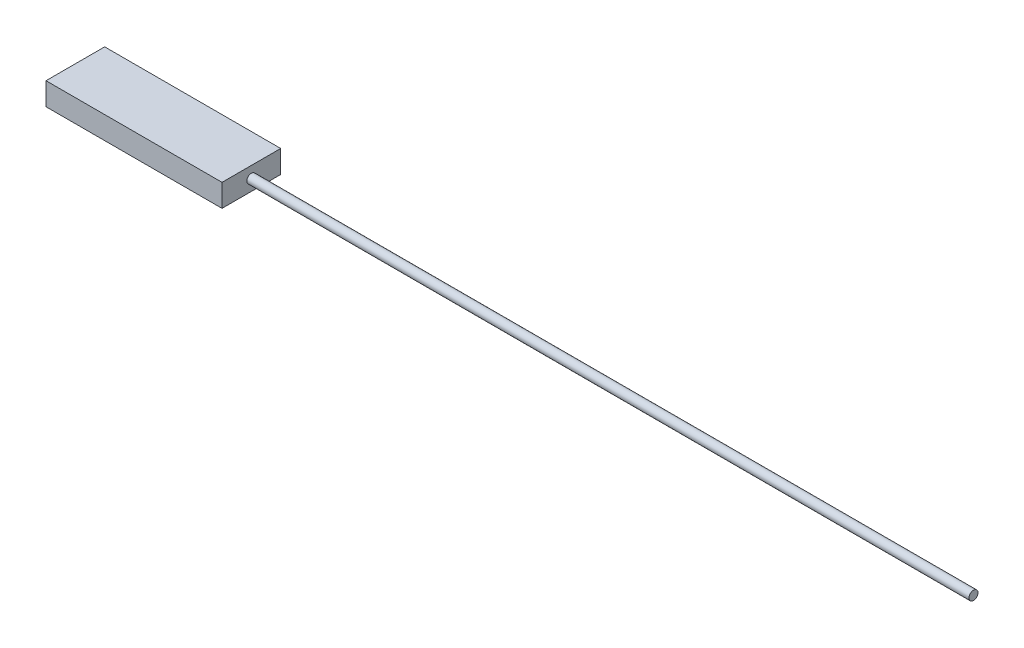
ISO-10303-21;
HEADER;
FILE_DESCRIPTION(('STEP AP214'),'2;1');
FILE_NAME('part.step','',(''),(''),'','','');
FILE_SCHEMA(('AUTOMOTIVE_DESIGN { 1 0 10303 214 1 1 1 1 }'));
ENDSEC;
DATA;
#1=APPLICATION_CONTEXT('core data for automotive mechanical design processes');
#2=APPLICATION_PROTOCOL_DEFINITION('international standard','automotive_design',2000,#1);
#3=PRODUCT_CONTEXT('',#1,'mechanical');
#4=PRODUCT('Part','Part','',(#3));
#5=PRODUCT_RELATED_PRODUCT_CATEGORY('part','',(#4));
#6=PRODUCT_DEFINITION_FORMATION('','',#4);
#7=PRODUCT_DEFINITION_CONTEXT('part definition',#1,'design');
#8=PRODUCT_DEFINITION('design','',#6,#7);
#9=PRODUCT_DEFINITION_SHAPE('','',#8);
#10=(LENGTH_UNIT() NAMED_UNIT(*) SI_UNIT(.MILLI.,.METRE.));
#11=(NAMED_UNIT(*) PLANE_ANGLE_UNIT() SI_UNIT($,.RADIAN.));
#12=(NAMED_UNIT(*) SI_UNIT($,.STERADIAN.) SOLID_ANGLE_UNIT());
#13=UNCERTAINTY_MEASURE_WITH_UNIT(LENGTH_MEASURE(1.E-05),#10,'distance_accuracy_value','');
#14=(GEOMETRIC_REPRESENTATION_CONTEXT(3) GLOBAL_UNCERTAINTY_ASSIGNED_CONTEXT((#13)) GLOBAL_UNIT_ASSIGNED_CONTEXT((#10,
#11,#12)) REPRESENTATION_CONTEXT('',''));
#15=CARTESIAN_POINT('',(0.,0.,0.));
#16=DIRECTION('',(0.,0.,1.));
#17=DIRECTION('',(1.,0.,0.));
#18=AXIS2_PLACEMENT_3D('',#15,#16,#17);
#19=CARTESIAN_POINT('',(49.53,12.7,16.51));
#20=DIRECTION('',(-1.,0.,0.));
#21=DIRECTION('',(0.,0.,1.));
#22=AXIS2_PLACEMENT_3D('',#19,#20,#21);
#23=PLANE('',#22);
#24=CARTESIAN_POINT('',(49.53,6.35,0.));
#25=DIRECTION('',(-1.,0.,0.));
#26=DIRECTION('',(0.,0.,1.));
#27=AXIS2_PLACEMENT_3D('',#24,#25,#26);
#28=CIRCLE('',#27,2.54);
#29=CARTESIAN_POINT('',(49.53,6.35,2.54));
#30=VERTEX_POINT('',#29);
#31=EDGE_CURVE('E11',#30,#30,#28,.F.);
#32=ORIENTED_EDGE('',*,*,#31,.F.);
#33=EDGE_LOOP('',(#32));
#34=FACE_BOUND('',#33,.T.);
#35=DIRECTION('',(0.,0.,-1.));
#36=VECTOR('',#35,1.);
#37=CARTESIAN_POINT('',(49.53,0.,16.51));
#38=LINE('',#37,#36);
#39=CARTESIAN_POINT('',(49.53,0.,16.51));
#40=VERTEX_POINT('',#39);
#41=CARTESIAN_POINT('',(49.53,0.,-16.51));
#42=VERTEX_POINT('',#41);
#43=EDGE_CURVE('E99',#40,#42,#38,.T.);
#44=ORIENTED_EDGE('',*,*,#43,.T.);
#45=DIRECTION('',(0.,-1.,0.));
#46=VECTOR('',#45,1.);
#47=CARTESIAN_POINT('',(49.53,12.7,-16.51));
#48=LINE('',#47,#46);
#49=CARTESIAN_POINT('',(49.53,12.7,-16.51));
#50=VERTEX_POINT('',#49);
#51=EDGE_CURVE('E41',#50,#42,#48,.T.);
#52=ORIENTED_EDGE('',*,*,#51,.F.);
#53=DIRECTION('',(0.,0.,-1.));
#54=VECTOR('',#53,1.);
#55=CARTESIAN_POINT('',(49.53,12.7,16.51));
#56=LINE('',#55,#54);
#57=CARTESIAN_POINT('',(49.53,12.7,16.51));
#58=VERTEX_POINT('',#57);
#59=EDGE_CURVE('E85',#58,#50,#56,.T.);
#60=ORIENTED_EDGE('',*,*,#59,.F.);
#61=DIRECTION('',(0.,-1.,0.));
#62=VECTOR('',#61,1.);
#63=CARTESIAN_POINT('',(49.53,12.7,16.51));
#64=LINE('',#63,#62);
#65=EDGE_CURVE('E95',#58,#40,#64,.T.);
#66=ORIENTED_EDGE('',*,*,#65,.T.);
#67=EDGE_LOOP('',(#44,#52,#60,#66));
#68=FACE_BOUND('',#67,.T.);
#69=ADVANCED_FACE('F33',(#34,#68),#23,.F.);
#70=CARTESIAN_POINT('',(-49.53,12.7,-16.51));
#71=DIRECTION('',(0.,0.,1.));
#72=DIRECTION('',(1.,0.,0.));
#73=AXIS2_PLACEMENT_3D('',#70,#71,#72);
#74=PLANE('',#73);
#75=DIRECTION('',(-1.,0.,0.));
#76=VECTOR('',#75,1.);
#77=CARTESIAN_POINT('',(-49.53,0.,-16.51));
#78=LINE('',#77,#76);
#79=CARTESIAN_POINT('',(-49.53,0.,-16.51));
#80=VERTEX_POINT('',#79);
#81=EDGE_CURVE('E90',#42,#80,#78,.T.);
#82=ORIENTED_EDGE('',*,*,#81,.T.);
#83=DIRECTION('',(0.,-1.,0.));
#84=VECTOR('',#83,1.);
#85=CARTESIAN_POINT('',(-49.53,12.7,-16.51));
#86=LINE('',#85,#84);
#87=CARTESIAN_POINT('',(-49.53,12.7,-16.51));
#88=VERTEX_POINT('',#87);
#89=EDGE_CURVE('E88',#88,#80,#86,.T.);
#90=ORIENTED_EDGE('',*,*,#89,.F.);
#91=DIRECTION('',(-1.,0.,0.));
#92=VECTOR('',#91,1.);
#93=CARTESIAN_POINT('',(-49.53,12.7,-16.51));
#94=LINE('',#93,#92);
#95=EDGE_CURVE('E80',#50,#88,#94,.T.);
#96=ORIENTED_EDGE('',*,*,#95,.F.);
#97=ORIENTED_EDGE('',*,*,#51,.T.);
#98=EDGE_LOOP('',(#82,#90,#96,#97));
#99=FACE_BOUND('',#98,.T.);
#100=ADVANCED_FACE('F89',(#99),#74,.F.);
#101=CARTESIAN_POINT('',(-49.53,12.7,16.51));
#102=DIRECTION('',(1.,0.,0.));
#103=DIRECTION('',(0.,0.,-1.));
#104=AXIS2_PLACEMENT_3D('',#101,#102,#103);
#105=PLANE('',#104);
#106=DIRECTION('',(0.,0.,1.));
#107=VECTOR('',#106,1.);
#108=CARTESIAN_POINT('',(-49.53,0.,16.51));
#109=LINE('',#108,#107);
#110=CARTESIAN_POINT('',(-49.53,0.,16.51));
#111=VERTEX_POINT('',#110);
#112=EDGE_CURVE('E66',#80,#111,#109,.T.);
#113=ORIENTED_EDGE('',*,*,#112,.T.);
#114=DIRECTION('',(0.,-1.,0.));
#115=VECTOR('',#114,1.);
#116=CARTESIAN_POINT('',(-49.53,12.7,16.51));
#117=LINE('',#116,#115);
#118=CARTESIAN_POINT('',(-49.53,12.7,16.51));
#119=VERTEX_POINT('',#118);
#120=EDGE_CURVE('E91',#119,#111,#117,.T.);
#121=ORIENTED_EDGE('',*,*,#120,.F.);
#122=DIRECTION('',(0.,0.,1.));
#123=VECTOR('',#122,1.);
#124=CARTESIAN_POINT('',(-49.53,12.7,16.51));
#125=LINE('',#124,#123);
#126=EDGE_CURVE('E83',#88,#119,#125,.T.);
#127=ORIENTED_EDGE('',*,*,#126,.F.);
#128=ORIENTED_EDGE('',*,*,#89,.T.);
#129=EDGE_LOOP('',(#113,#121,#127,#128));
#130=FACE_BOUND('',#129,.T.);
#131=ADVANCED_FACE('F93',(#130),#105,.F.);
#132=CARTESIAN_POINT('',(-49.53,12.7,16.51));
#133=DIRECTION('',(0.,0.,-1.));
#134=DIRECTION('',(-1.,0.,0.));
#135=AXIS2_PLACEMENT_3D('',#132,#133,#134);
#136=PLANE('',#135);
#137=DIRECTION('',(1.,0.,0.));
#138=VECTOR('',#137,1.);
#139=CARTESIAN_POINT('',(-49.53,0.,16.51));
#140=LINE('',#139,#138);
#141=EDGE_CURVE('E72',#111,#40,#140,.T.);
#142=ORIENTED_EDGE('',*,*,#141,.T.);
#143=ORIENTED_EDGE('',*,*,#65,.F.);
#144=DIRECTION('',(1.,0.,0.));
#145=VECTOR('',#144,1.);
#146=CARTESIAN_POINT('',(-49.53,12.7,16.51));
#147=LINE('',#146,#145);
#148=EDGE_CURVE('E49',#119,#58,#147,.T.);
#149=ORIENTED_EDGE('',*,*,#148,.F.);
#150=ORIENTED_EDGE('',*,*,#120,.T.);
#151=EDGE_LOOP('',(#142,#143,#149,#150));
#152=FACE_BOUND('',#151,.T.);
#153=ADVANCED_FACE('F121',(#152),#136,.F.);
#154=CARTESIAN_POINT('',(0.,12.7,0.));
#155=DIRECTION('',(0.,-1.,0.));
#156=DIRECTION('',(0.,0.,-1.));
#157=AXIS2_PLACEMENT_3D('',#154,#155,#156);
#158=PLANE('',#157);
#159=ORIENTED_EDGE('',*,*,#59,.T.);
#160=ORIENTED_EDGE('',*,*,#95,.T.);
#161=ORIENTED_EDGE('',*,*,#126,.T.);
#162=ORIENTED_EDGE('',*,*,#148,.T.);
#163=EDGE_LOOP('',(#159,#160,#161,#162));
#164=FACE_BOUND('',#163,.T.);
#165=ADVANCED_FACE('F81',(#164),#158,.F.);
#166=CARTESIAN_POINT('',(0.,0.,0.));
#167=DIRECTION('',(0.,-1.,0.));
#168=DIRECTION('',(0.,0.,-1.));
#169=AXIS2_PLACEMENT_3D('',#166,#167,#168);
#170=PLANE('',#169);
#171=ORIENTED_EDGE('',*,*,#43,.F.);
#172=ORIENTED_EDGE('',*,*,#141,.F.);
#173=ORIENTED_EDGE('',*,*,#112,.F.);
#174=ORIENTED_EDGE('',*,*,#81,.F.);
#175=EDGE_LOOP('',(#171,#172,#173,#174));
#176=FACE_BOUND('',#175,.T.);
#177=ADVANCED_FACE('F110',(#176),#170,.T.);
#178=CARTESIAN_POINT('',(455.93,6.35,0.));
#179=DIRECTION('',(-1.,0.,0.));
#180=DIRECTION('',(0.,0.,1.));
#181=AXIS2_PLACEMENT_3D('',#178,#179,#180);
#182=CYLINDRICAL_SURFACE('',#181,2.54);
#183=CARTESIAN_POINT('',(455.93,6.35,0.));
#184=DIRECTION('',(1.,0.,0.));
#185=DIRECTION('',(0.,0.,-1.));
#186=AXIS2_PLACEMENT_3D('',#183,#184,#185);
#187=CIRCLE('',#186,2.54);
#188=CARTESIAN_POINT('',(455.93,6.35,-2.54));
#189=VERTEX_POINT('',#188);
#190=EDGE_CURVE('E102',#189,#189,#187,.T.);
#191=ORIENTED_EDGE('',*,*,#190,.F.);
#192=EDGE_LOOP('',(#191));
#193=FACE_BOUND('',#192,.T.);
#194=ORIENTED_EDGE('',*,*,#31,.T.);
#195=EDGE_LOOP('',(#194));
#196=FACE_BOUND('',#195,.T.);
#197=ADVANCED_FACE('F112',(#193,#196),#182,.T.);
#198=CARTESIAN_POINT('',(455.93,6.35,0.));
#199=DIRECTION('',(1.,0.,0.));
#200=DIRECTION('',(0.,0.,-1.));
#201=AXIS2_PLACEMENT_3D('',#198,#199,#200);
#202=PLANE('',#201);
#203=ORIENTED_EDGE('',*,*,#190,.T.);
#204=EDGE_LOOP('',(#203));
#205=FACE_BOUND('',#204,.T.);
#206=ADVANCED_FACE('F118',(#205),#202,.T.);
#207=CLOSED_SHELL('',(#69,#100,#131,#153,#165,#177,#197,#206));
#208=MANIFOLD_SOLID_BREP('B2',#207);
#209=ADVANCED_BREP_SHAPE_REPRESENTATION('',(#18,#208),#14);
#210=SHAPE_DEFINITION_REPRESENTATION(#9,#209);
ENDSEC;
END-ISO-10303-21;
